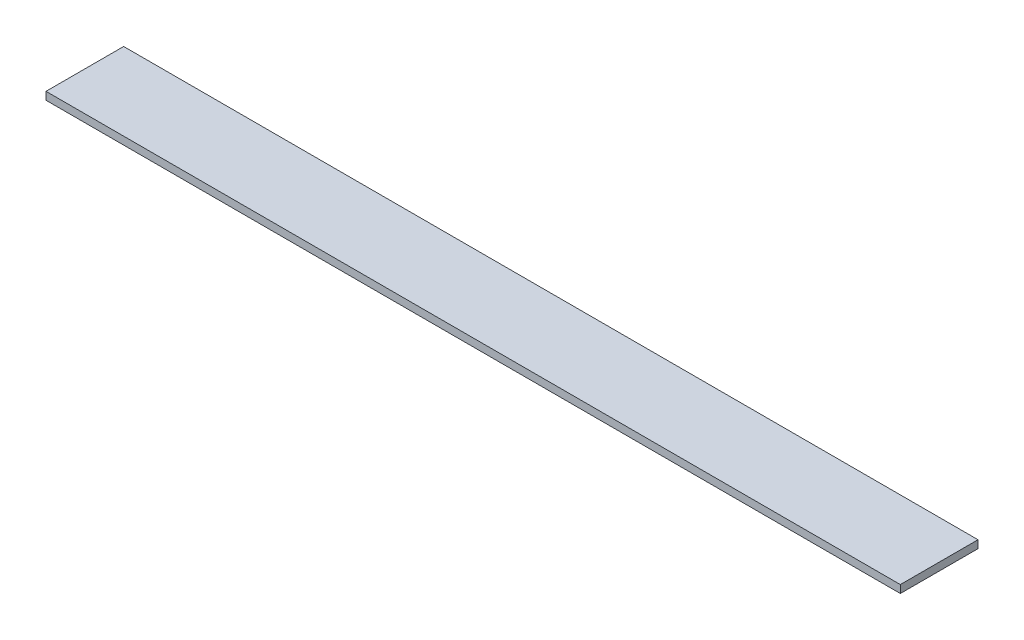
ISO-10303-21;
HEADER;
FILE_DESCRIPTION(('STEP AP214'),'2;1');
FILE_NAME('part.step','',(''),(''),'','','');
FILE_SCHEMA(('AUTOMOTIVE_DESIGN { 1 0 10303 214 1 1 1 1 }'));
ENDSEC;
DATA;
#1=APPLICATION_CONTEXT('core data for automotive mechanical design processes');
#2=APPLICATION_PROTOCOL_DEFINITION('international standard','automotive_design',2000,#1);
#3=PRODUCT_CONTEXT('',#1,'mechanical');
#4=PRODUCT('Part','Part','',(#3));
#5=PRODUCT_RELATED_PRODUCT_CATEGORY('part','',(#4));
#6=PRODUCT_DEFINITION_FORMATION('','',#4);
#7=PRODUCT_DEFINITION_CONTEXT('part definition',#1,'design');
#8=PRODUCT_DEFINITION('design','',#6,#7);
#9=PRODUCT_DEFINITION_SHAPE('','',#8);
#10=(LENGTH_UNIT() NAMED_UNIT(*) SI_UNIT(.MILLI.,.METRE.));
#11=(NAMED_UNIT(*) PLANE_ANGLE_UNIT() SI_UNIT($,.RADIAN.));
#12=(NAMED_UNIT(*) SI_UNIT($,.STERADIAN.) SOLID_ANGLE_UNIT());
#13=UNCERTAINTY_MEASURE_WITH_UNIT(LENGTH_MEASURE(1.E-05),#10,'distance_accuracy_value','');
#14=(GEOMETRIC_REPRESENTATION_CONTEXT(3) GLOBAL_UNCERTAINTY_ASSIGNED_CONTEXT((#13)) GLOBAL_UNIT_ASSIGNED_CONTEXT((#10,
#11,#12)) REPRESENTATION_CONTEXT('',''));
#15=CARTESIAN_POINT('',(0.,0.,0.));
#16=DIRECTION('',(0.,0.,1.));
#17=DIRECTION('',(1.,0.,0.));
#18=AXIS2_PLACEMENT_3D('',#15,#16,#17);
#19=CARTESIAN_POINT('',(0.,10.,0.));
#20=DIRECTION('',(1.,0.,0.));
#21=DIRECTION('',(0.,0.,-1.));
#22=AXIS2_PLACEMENT_3D('',#19,#20,#21);
#23=PLANE('',#22);
#24=DIRECTION('',(0.,0.,1.));
#25=VECTOR('',#24,1.);
#26=CARTESIAN_POINT('',(0.,0.,0.));
#27=LINE('',#26,#25);
#28=CARTESIAN_POINT('',(0.,0.,-100.));
#29=VERTEX_POINT('',#28);
#30=CARTESIAN_POINT('',(0.,0.,0.));
#31=VERTEX_POINT('',#30);
#32=EDGE_CURVE('E94',#29,#31,#27,.T.);
#33=ORIENTED_EDGE('',*,*,#32,.T.);
#34=DIRECTION('',(0.,-1.,0.));
#35=VECTOR('',#34,1.);
#36=CARTESIAN_POINT('',(0.,10.,0.));
#37=LINE('',#36,#35);
#38=CARTESIAN_POINT('',(0.,10.,0.));
#39=VERTEX_POINT('',#38);
#40=EDGE_CURVE('E11',#39,#31,#37,.T.);
#41=ORIENTED_EDGE('',*,*,#40,.F.);
#42=DIRECTION('',(0.,0.,1.));
#43=VECTOR('',#42,1.);
#44=CARTESIAN_POINT('',(0.,10.,0.));
#45=LINE('',#44,#43);
#46=CARTESIAN_POINT('',(0.,10.,-100.));
#47=VERTEX_POINT('',#46);
#48=EDGE_CURVE('E82',#47,#39,#45,.T.);
#49=ORIENTED_EDGE('',*,*,#48,.F.);
#50=DIRECTION('',(0.,-1.,0.));
#51=VECTOR('',#50,1.);
#52=CARTESIAN_POINT('',(0.,10.,-100.));
#53=LINE('',#52,#51);
#54=EDGE_CURVE('E90',#47,#29,#53,.T.);
#55=ORIENTED_EDGE('',*,*,#54,.T.);
#56=EDGE_LOOP('',(#33,#41,#49,#55));
#57=FACE_BOUND('',#56,.T.);
#58=ADVANCED_FACE('F31',(#57),#23,.F.);
#59=CARTESIAN_POINT('',(0.,10.,0.));
#60=DIRECTION('',(0.,0.,-1.));
#61=DIRECTION('',(-1.,0.,0.));
#62=AXIS2_PLACEMENT_3D('',#59,#60,#61);
#63=PLANE('',#62);
#64=DIRECTION('',(1.,0.,0.));
#65=VECTOR('',#64,1.);
#66=CARTESIAN_POINT('',(0.,0.,0.));
#67=LINE('',#66,#65);
#68=CARTESIAN_POINT('',(1100.,0.,0.));
#69=VERTEX_POINT('',#68);
#70=EDGE_CURVE('E86',#31,#69,#67,.T.);
#71=ORIENTED_EDGE('',*,*,#70,.T.);
#72=DIRECTION('',(0.,-1.,0.));
#73=VECTOR('',#72,1.);
#74=CARTESIAN_POINT('',(1100.,10.,0.));
#75=LINE('',#74,#73);
#76=CARTESIAN_POINT('',(1100.,10.,0.));
#77=VERTEX_POINT('',#76);
#78=EDGE_CURVE('E39',#77,#69,#75,.T.);
#79=ORIENTED_EDGE('',*,*,#78,.F.);
#80=DIRECTION('',(1.,0.,0.));
#81=VECTOR('',#80,1.);
#82=CARTESIAN_POINT('',(0.,10.,0.));
#83=LINE('',#82,#81);
#84=EDGE_CURVE('E77',#39,#77,#83,.T.);
#85=ORIENTED_EDGE('',*,*,#84,.F.);
#86=ORIENTED_EDGE('',*,*,#40,.T.);
#87=EDGE_LOOP('',(#71,#79,#85,#86));
#88=FACE_BOUND('',#87,.T.);
#89=ADVANCED_FACE('F85',(#88),#63,.F.);
#90=CARTESIAN_POINT('',(1100.,10.,0.));
#91=DIRECTION('',(-1.,0.,0.));
#92=DIRECTION('',(0.,0.,1.));
#93=AXIS2_PLACEMENT_3D('',#90,#91,#92);
#94=PLANE('',#93);
#95=DIRECTION('',(0.,0.,-1.));
#96=VECTOR('',#95,1.);
#97=CARTESIAN_POINT('',(1100.,0.,0.));
#98=LINE('',#97,#96);
#99=CARTESIAN_POINT('',(1100.,0.,-100.));
#100=VERTEX_POINT('',#99);
#101=EDGE_CURVE('E64',#69,#100,#98,.T.);
#102=ORIENTED_EDGE('',*,*,#101,.T.);
#103=DIRECTION('',(0.,-1.,0.));
#104=VECTOR('',#103,1.);
#105=CARTESIAN_POINT('',(1100.,10.,-100.));
#106=LINE('',#105,#104);
#107=CARTESIAN_POINT('',(1100.,10.,-100.));
#108=VERTEX_POINT('',#107);
#109=EDGE_CURVE('E87',#108,#100,#106,.T.);
#110=ORIENTED_EDGE('',*,*,#109,.F.);
#111=DIRECTION('',(0.,0.,-1.));
#112=VECTOR('',#111,1.);
#113=CARTESIAN_POINT('',(1100.,10.,0.));
#114=LINE('',#113,#112);
#115=EDGE_CURVE('E80',#77,#108,#114,.T.);
#116=ORIENTED_EDGE('',*,*,#115,.F.);
#117=ORIENTED_EDGE('',*,*,#78,.T.);
#118=EDGE_LOOP('',(#102,#110,#116,#117));
#119=FACE_BOUND('',#118,.T.);
#120=ADVANCED_FACE('F88',(#119),#94,.F.);
#121=CARTESIAN_POINT('',(0.,10.,-100.));
#122=DIRECTION('',(0.,0.,1.));
#123=DIRECTION('',(1.,0.,0.));
#124=AXIS2_PLACEMENT_3D('',#121,#122,#123);
#125=PLANE('',#124);
#126=DIRECTION('',(-1.,0.,0.));
#127=VECTOR('',#126,1.);
#128=CARTESIAN_POINT('',(0.,0.,-100.));
#129=LINE('',#128,#127);
#130=EDGE_CURVE('E70',#100,#29,#129,.T.);
#131=ORIENTED_EDGE('',*,*,#130,.T.);
#132=ORIENTED_EDGE('',*,*,#54,.F.);
#133=DIRECTION('',(-1.,0.,0.));
#134=VECTOR('',#133,1.);
#135=CARTESIAN_POINT('',(0.,10.,-100.));
#136=LINE('',#135,#134);
#137=EDGE_CURVE('E47',#108,#47,#136,.T.);
#138=ORIENTED_EDGE('',*,*,#137,.F.);
#139=ORIENTED_EDGE('',*,*,#109,.T.);
#140=EDGE_LOOP('',(#131,#132,#138,#139));
#141=FACE_BOUND('',#140,.T.);
#142=ADVANCED_FACE('F101',(#141),#125,.F.);
#143=CARTESIAN_POINT('',(0.,10.,-100.));
#144=DIRECTION('',(0.,-1.,0.));
#145=DIRECTION('',(0.,0.,-1.));
#146=AXIS2_PLACEMENT_3D('',#143,#144,#145);
#147=PLANE('',#146);
#148=ORIENTED_EDGE('',*,*,#48,.T.);
#149=ORIENTED_EDGE('',*,*,#84,.T.);
#150=ORIENTED_EDGE('',*,*,#115,.T.);
#151=ORIENTED_EDGE('',*,*,#137,.T.);
#152=EDGE_LOOP('',(#148,#149,#150,#151));
#153=FACE_BOUND('',#152,.T.);
#154=ADVANCED_FACE('F78',(#153),#147,.F.);
#155=CARTESIAN_POINT('',(0.,0.,-100.));
#156=DIRECTION('',(0.,-1.,0.));
#157=DIRECTION('',(0.,0.,-1.));
#158=AXIS2_PLACEMENT_3D('',#155,#156,#157);
#159=PLANE('',#158);
#160=ORIENTED_EDGE('',*,*,#32,.F.);
#161=ORIENTED_EDGE('',*,*,#130,.F.);
#162=ORIENTED_EDGE('',*,*,#101,.F.);
#163=ORIENTED_EDGE('',*,*,#70,.F.);
#164=EDGE_LOOP('',(#160,#161,#162,#163));
#165=FACE_BOUND('',#164,.T.);
#166=ADVANCED_FACE('F104',(#165),#159,.T.);
#167=CLOSED_SHELL('',(#58,#89,#120,#142,#154,#166));
#168=MANIFOLD_SOLID_BREP('B2',#167);
#169=ADVANCED_BREP_SHAPE_REPRESENTATION('',(#18,#168),#14);
#170=SHAPE_DEFINITION_REPRESENTATION(#9,#169);
ENDSEC;
END-ISO-10303-21;
